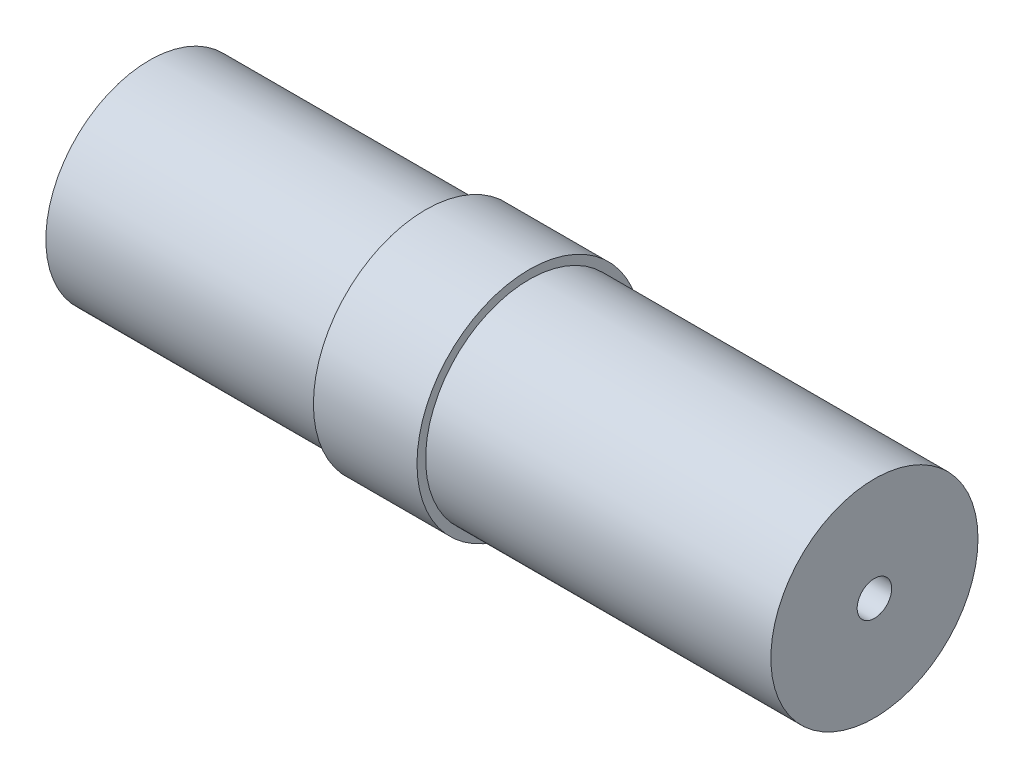
ISO-10303-21;
HEADER;
FILE_DESCRIPTION(('STEP AP214'),'2;1');
FILE_NAME('part.step','',(''),(''),'','','');
FILE_SCHEMA(('AUTOMOTIVE_DESIGN { 1 0 10303 214 1 1 1 1 }'));
ENDSEC;
DATA;
#1=APPLICATION_CONTEXT('core data for automotive mechanical design processes');
#2=APPLICATION_PROTOCOL_DEFINITION('international standard','automotive_design',2000,#1);
#3=PRODUCT_CONTEXT('',#1,'mechanical');
#4=PRODUCT('Part','Part','',(#3));
#5=PRODUCT_RELATED_PRODUCT_CATEGORY('part','',(#4));
#6=PRODUCT_DEFINITION_FORMATION('','',#4);
#7=PRODUCT_DEFINITION_CONTEXT('part definition',#1,'design');
#8=PRODUCT_DEFINITION('design','',#6,#7);
#9=PRODUCT_DEFINITION_SHAPE('','',#8);
#10=(LENGTH_UNIT() NAMED_UNIT(*) SI_UNIT(.MILLI.,.METRE.));
#11=(NAMED_UNIT(*) PLANE_ANGLE_UNIT() SI_UNIT($,.RADIAN.));
#12=(NAMED_UNIT(*) SI_UNIT($,.STERADIAN.) SOLID_ANGLE_UNIT());
#13=UNCERTAINTY_MEASURE_WITH_UNIT(LENGTH_MEASURE(1.E-05),#10,'distance_accuracy_value','');
#14=(GEOMETRIC_REPRESENTATION_CONTEXT(3) GLOBAL_UNCERTAINTY_ASSIGNED_CONTEXT((#13)) GLOBAL_UNIT_ASSIGNED_CONTEXT((#10,
#11,#12)) REPRESENTATION_CONTEXT('',''));
#15=CARTESIAN_POINT('',(0.,0.,0.));
#16=DIRECTION('',(0.,0.,1.));
#17=DIRECTION('',(1.,0.,0.));
#18=AXIS2_PLACEMENT_3D('',#15,#16,#17);
#19=CARTESIAN_POINT('',(13.5,0.,0.));
#20=DIRECTION('',(1.,0.,0.));
#21=DIRECTION('',(0.,0.,-1.));
#22=AXIS2_PLACEMENT_3D('',#19,#20,#21);
#23=CYLINDRICAL_SURFACE('',#22,3.25);
#24=CARTESIAN_POINT('',(-2.,0.,0.));
#25=DIRECTION('',(1.,0.,0.));
#26=DIRECTION('',(0.,0.,-1.));
#27=AXIS2_PLACEMENT_3D('',#24,#25,#26);
#28=CIRCLE('',#27,3.25);
#29=CARTESIAN_POINT('',(-2.,0.,-3.25));
#30=VERTEX_POINT('',#29);
#31=EDGE_CURVE('E10',#30,#30,#28,.T.);
#32=ORIENTED_EDGE('',*,*,#31,.T.);
#33=EDGE_LOOP('',(#32));
#34=FACE_BOUND('',#33,.T.);
#35=CARTESIAN_POINT('',(1.,0.,0.));
#36=DIRECTION('',(1.,0.,0.));
#37=DIRECTION('',(0.,0.,-1.));
#38=AXIS2_PLACEMENT_3D('',#35,#36,#37);
#39=CIRCLE('',#38,3.25);
#40=CARTESIAN_POINT('',(1.,0.,-3.25));
#41=VERTEX_POINT('',#40);
#42=EDGE_CURVE('E88',#41,#41,#39,.T.);
#43=ORIENTED_EDGE('',*,*,#42,.F.);
#44=EDGE_LOOP('',(#43));
#45=FACE_BOUND('',#44,.T.);
#46=ADVANCED_FACE('F45',(#34,#45),#23,.T.);
#47=CARTESIAN_POINT('',(-2.,3.25,0.));
#48=DIRECTION('',(-1.,0.,0.));
#49=DIRECTION('',(0.,0.,1.));
#50=AXIS2_PLACEMENT_3D('',#47,#48,#49);
#51=PLANE('',#50);
#52=CARTESIAN_POINT('',(-2.,0.,0.));
#53=DIRECTION('',(1.,0.,0.));
#54=DIRECTION('',(0.,0.,-1.));
#55=AXIS2_PLACEMENT_3D('',#52,#53,#54);
#56=CIRCLE('',#55,3.);
#57=CARTESIAN_POINT('',(-2.,0.,-3.));
#58=VERTEX_POINT('',#57);
#59=EDGE_CURVE('E52',#58,#58,#56,.T.);
#60=ORIENTED_EDGE('',*,*,#59,.T.);
#61=EDGE_LOOP('',(#60));
#62=FACE_BOUND('',#61,.T.);
#63=ORIENTED_EDGE('',*,*,#31,.F.);
#64=EDGE_LOOP('',(#63));
#65=FACE_BOUND('',#64,.T.);
#66=ADVANCED_FACE('F97',(#62,#65),#51,.T.);
#67=CARTESIAN_POINT('',(13.5,0.,0.));
#68=DIRECTION('',(1.,0.,0.));
#69=DIRECTION('',(0.,0.,-1.));
#70=AXIS2_PLACEMENT_3D('',#67,#68,#69);
#71=CYLINDRICAL_SURFACE('',#70,3.);
#72=CARTESIAN_POINT('',(-10.,0.,0.));
#73=DIRECTION('',(1.,0.,0.));
#74=DIRECTION('',(0.,0.,-1.));
#75=AXIS2_PLACEMENT_3D('',#72,#73,#74);
#76=CIRCLE('',#75,3.);
#77=CARTESIAN_POINT('',(-10.,0.,-3.));
#78=VERTEX_POINT('',#77);
#79=EDGE_CURVE('E57',#78,#78,#76,.T.);
#80=ORIENTED_EDGE('',*,*,#79,.T.);
#81=EDGE_LOOP('',(#80));
#82=FACE_BOUND('',#81,.T.);
#83=ORIENTED_EDGE('',*,*,#59,.F.);
#84=EDGE_LOOP('',(#83));
#85=FACE_BOUND('',#84,.T.);
#86=ADVANCED_FACE('F101',(#82,#85),#71,.T.);
#87=CARTESIAN_POINT('',(-10.,3.,0.));
#88=DIRECTION('',(-1.,0.,0.));
#89=DIRECTION('',(0.,0.,1.));
#90=AXIS2_PLACEMENT_3D('',#87,#88,#89);
#91=PLANE('',#90);
#92=CARTESIAN_POINT('',(-10.,0.,0.));
#93=DIRECTION('',(1.,0.,0.));
#94=DIRECTION('',(0.,0.,-1.));
#95=AXIS2_PLACEMENT_3D('',#92,#93,#94);
#96=CIRCLE('',#95,2.25);
#97=CARTESIAN_POINT('',(-10.,0.,-2.25));
#98=VERTEX_POINT('',#97);
#99=EDGE_CURVE('E62',#98,#98,#96,.T.);
#100=ORIENTED_EDGE('',*,*,#99,.T.);
#101=EDGE_LOOP('',(#100));
#102=FACE_BOUND('',#101,.T.);
#103=ORIENTED_EDGE('',*,*,#79,.F.);
#104=EDGE_LOOP('',(#103));
#105=FACE_BOUND('',#104,.T.);
#106=ADVANCED_FACE('F105',(#102,#105),#91,.T.);
#107=CARTESIAN_POINT('',(13.5,0.,0.));
#108=DIRECTION('',(1.,0.,0.));
#109=DIRECTION('',(0.,0.,-1.));
#110=AXIS2_PLACEMENT_3D('',#107,#108,#109);
#111=CYLINDRICAL_SURFACE('',#110,2.25);
#112=CARTESIAN_POINT('',(10.,0.,0.));
#113=DIRECTION('',(1.,0.,0.));
#114=DIRECTION('',(0.,0.,-1.));
#115=AXIS2_PLACEMENT_3D('',#112,#113,#114);
#116=CIRCLE('',#115,2.25);
#117=CARTESIAN_POINT('',(10.,0.,-2.25));
#118=VERTEX_POINT('',#117);
#119=EDGE_CURVE('E68',#118,#118,#116,.T.);
#120=ORIENTED_EDGE('',*,*,#119,.T.);
#121=EDGE_LOOP('',(#120));
#122=FACE_BOUND('',#121,.T.);
#123=ORIENTED_EDGE('',*,*,#99,.F.);
#124=EDGE_LOOP('',(#123));
#125=FACE_BOUND('',#124,.T.);
#126=ADVANCED_FACE('F112',(#122,#125),#111,.F.);
#127=CARTESIAN_POINT('',(10.,0.499999999999998,0.));
#128=DIRECTION('',(-1.,0.,0.));
#129=DIRECTION('',(0.,0.,1.));
#130=AXIS2_PLACEMENT_3D('',#127,#128,#129);
#131=PLANE('',#130);
#132=CARTESIAN_POINT('',(10.,0.,0.));
#133=DIRECTION('',(1.,0.,0.));
#134=DIRECTION('',(0.,0.,-1.));
#135=AXIS2_PLACEMENT_3D('',#132,#133,#134);
#136=CIRCLE('',#135,0.499999999999998);
#137=CARTESIAN_POINT('',(10.,0.,-0.499999999999998));
#138=VERTEX_POINT('',#137);
#139=EDGE_CURVE('E72',#138,#138,#136,.T.);
#140=ORIENTED_EDGE('',*,*,#139,.T.);
#141=EDGE_LOOP('',(#140));
#142=FACE_BOUND('',#141,.T.);
#143=ORIENTED_EDGE('',*,*,#119,.F.);
#144=EDGE_LOOP('',(#143));
#145=FACE_BOUND('',#144,.T.);
#146=ADVANCED_FACE('F116',(#142,#145),#131,.T.);
#147=CARTESIAN_POINT('',(13.5,0.,0.));
#148=DIRECTION('',(1.,0.,0.));
#149=DIRECTION('',(0.,0.,-1.));
#150=AXIS2_PLACEMENT_3D('',#147,#148,#149);
#151=CYLINDRICAL_SURFACE('',#150,0.499999999999998);
#152=CARTESIAN_POINT('',(11.,0.,0.));
#153=DIRECTION('',(1.,0.,0.));
#154=DIRECTION('',(0.,0.,-1.));
#155=AXIS2_PLACEMENT_3D('',#152,#153,#154);
#156=CIRCLE('',#155,0.499999999999998);
#157=CARTESIAN_POINT('',(11.,0.,-0.499999999999998));
#158=VERTEX_POINT('',#157);
#159=EDGE_CURVE('E76',#158,#158,#156,.T.);
#160=ORIENTED_EDGE('',*,*,#159,.T.);
#161=EDGE_LOOP('',(#160));
#162=FACE_BOUND('',#161,.T.);
#163=ORIENTED_EDGE('',*,*,#139,.F.);
#164=EDGE_LOOP('',(#163));
#165=FACE_BOUND('',#164,.T.);
#166=ADVANCED_FACE('F120',(#162,#165),#151,.F.);
#167=CARTESIAN_POINT('',(11.,2.99999999999999,0.));
#168=DIRECTION('',(1.,0.,0.));
#169=DIRECTION('',(0.,0.,-1.));
#170=AXIS2_PLACEMENT_3D('',#167,#168,#169);
#171=PLANE('',#170);
#172=CARTESIAN_POINT('',(11.,0.,0.));
#173=DIRECTION('',(1.,0.,0.));
#174=DIRECTION('',(0.,0.,-1.));
#175=AXIS2_PLACEMENT_3D('',#172,#173,#174);
#176=CIRCLE('',#175,2.99999999999999);
#177=CARTESIAN_POINT('',(11.,0.,-2.99999999999999));
#178=VERTEX_POINT('',#177);
#179=EDGE_CURVE('E80',#178,#178,#176,.T.);
#180=ORIENTED_EDGE('',*,*,#179,.T.);
#181=EDGE_LOOP('',(#180));
#182=FACE_BOUND('',#181,.T.);
#183=ORIENTED_EDGE('',*,*,#159,.F.);
#184=EDGE_LOOP('',(#183));
#185=FACE_BOUND('',#184,.T.);
#186=ADVANCED_FACE('F124',(#182,#185),#171,.T.);
#187=CARTESIAN_POINT('',(13.5,0.,0.));
#188=DIRECTION('',(1.,0.,0.));
#189=DIRECTION('',(0.,0.,-1.));
#190=AXIS2_PLACEMENT_3D('',#187,#188,#189);
#191=CYLINDRICAL_SURFACE('',#190,2.99999999999999);
#192=CARTESIAN_POINT('',(1.,0.,0.));
#193=DIRECTION('',(1.,0.,0.));
#194=DIRECTION('',(0.,0.,-1.));
#195=AXIS2_PLACEMENT_3D('',#192,#193,#194);
#196=CIRCLE('',#195,3.);
#197=CARTESIAN_POINT('',(1.,0.,-3.));
#198=VERTEX_POINT('',#197);
#199=EDGE_CURVE('E84',#198,#198,#196,.T.);
#200=ORIENTED_EDGE('',*,*,#199,.T.);
#201=EDGE_LOOP('',(#200));
#202=FACE_BOUND('',#201,.T.);
#203=ORIENTED_EDGE('',*,*,#179,.F.);
#204=EDGE_LOOP('',(#203));
#205=FACE_BOUND('',#204,.T.);
#206=ADVANCED_FACE('F128',(#202,#205),#191,.T.);
#207=CARTESIAN_POINT('',(1.,3.25,0.));
#208=DIRECTION('',(1.,0.,0.));
#209=DIRECTION('',(0.,0.,-1.));
#210=AXIS2_PLACEMENT_3D('',#207,#208,#209);
#211=PLANE('',#210);
#212=ORIENTED_EDGE('',*,*,#42,.T.);
#213=EDGE_LOOP('',(#212));
#214=FACE_BOUND('',#213,.T.);
#215=ORIENTED_EDGE('',*,*,#199,.F.);
#216=EDGE_LOOP('',(#215));
#217=FACE_BOUND('',#216,.T.);
#218=ADVANCED_FACE('F93',(#214,#217),#211,.T.);
#219=CLOSED_SHELL('',(#46,#66,#86,#106,#126,#146,#166,#186,#206,#218));
#220=MANIFOLD_SOLID_BREP('B2',#219);
#221=ADVANCED_BREP_SHAPE_REPRESENTATION('',(#18,#220),#14);
#222=SHAPE_DEFINITION_REPRESENTATION(#9,#221);
ENDSEC;
END-ISO-10303-21;
